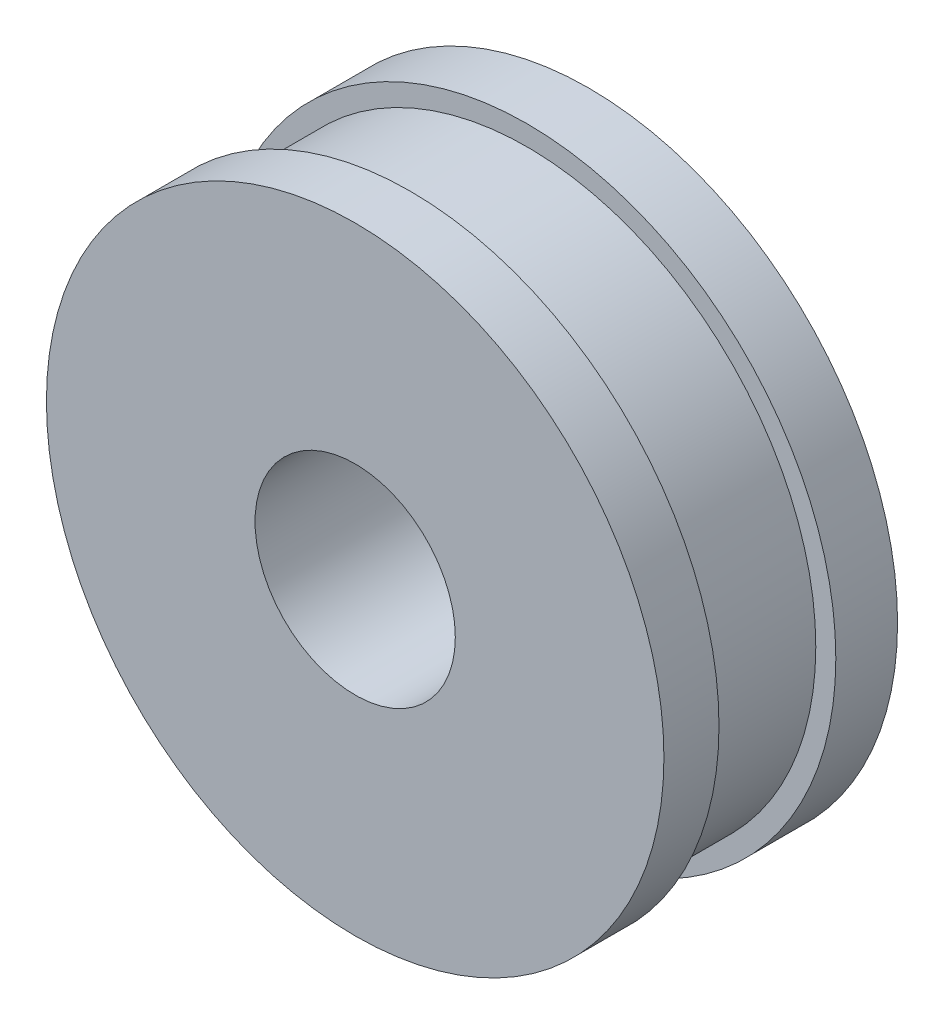
ISO-10303-21;
HEADER;
FILE_DESCRIPTION(('STEP AP214'),'2;1');
FILE_NAME('part.step','',(''),(''),'','','');
FILE_SCHEMA(('AUTOMOTIVE_DESIGN { 1 0 10303 214 1 1 1 1 }'));
ENDSEC;
DATA;
#1=APPLICATION_CONTEXT('core data for automotive mechanical design processes');
#2=APPLICATION_PROTOCOL_DEFINITION('international standard','automotive_design',2000,#1);
#3=PRODUCT_CONTEXT('',#1,'mechanical');
#4=PRODUCT('Part','Part','',(#3));
#5=PRODUCT_RELATED_PRODUCT_CATEGORY('part','',(#4));
#6=PRODUCT_DEFINITION_FORMATION('','',#4);
#7=PRODUCT_DEFINITION_CONTEXT('part definition',#1,'design');
#8=PRODUCT_DEFINITION('design','',#6,#7);
#9=PRODUCT_DEFINITION_SHAPE('','',#8);
#10=(LENGTH_UNIT() NAMED_UNIT(*) SI_UNIT(.MILLI.,.METRE.));
#11=(NAMED_UNIT(*) PLANE_ANGLE_UNIT() SI_UNIT($,.RADIAN.));
#12=(NAMED_UNIT(*) SI_UNIT($,.STERADIAN.) SOLID_ANGLE_UNIT());
#13=UNCERTAINTY_MEASURE_WITH_UNIT(LENGTH_MEASURE(1.E-05),#10,'distance_accuracy_value','');
#14=(GEOMETRIC_REPRESENTATION_CONTEXT(3) GLOBAL_UNCERTAINTY_ASSIGNED_CONTEXT((#13)) GLOBAL_UNIT_ASSIGNED_CONTEXT((#10,
#11,#12)) REPRESENTATION_CONTEXT('',''));
#15=CARTESIAN_POINT('',(0.,0.,0.));
#16=DIRECTION('',(0.,0.,1.));
#17=DIRECTION('',(1.,0.,0.));
#18=AXIS2_PLACEMENT_3D('',#15,#16,#17);
#19=CARTESIAN_POINT('',(0.,0.,14.));
#20=DIRECTION('',(0.,0.,-1.));
#21=DIRECTION('',(-1.,0.,0.));
#22=AXIS2_PLACEMENT_3D('',#19,#20,#21);
#23=CYLINDRICAL_SURFACE('',#22,18.5);
#24=CARTESIAN_POINT('',(0.,0.,0.));
#25=DIRECTION('',(0.,0.,1.));
#26=DIRECTION('',(1.,0.,0.));
#27=AXIS2_PLACEMENT_3D('',#24,#25,#26);
#28=CIRCLE('',#27,18.5);
#29=CARTESIAN_POINT('',(18.5,0.,0.));
#30=VERTEX_POINT('',#29);
#31=EDGE_CURVE('E35',#30,#30,#28,.T.);
#32=ORIENTED_EDGE('',*,*,#31,.T.);
#33=EDGE_LOOP('',(#32));
#34=FACE_BOUND('',#33,.T.);
#35=CARTESIAN_POINT('',(0.,0.,3.7));
#36=DIRECTION('',(0.,0.,1.));
#37=DIRECTION('',(1.,0.,0.));
#38=AXIS2_PLACEMENT_3D('',#35,#36,#37);
#39=CIRCLE('',#38,18.5);
#40=CARTESIAN_POINT('',(18.5,0.,3.7));
#41=VERTEX_POINT('',#40);
#42=EDGE_CURVE('E47',#41,#41,#39,.T.);
#43=ORIENTED_EDGE('',*,*,#42,.F.);
#44=EDGE_LOOP('',(#43));
#45=FACE_BOUND('',#44,.T.);
#46=ADVANCED_FACE('F31',(#34,#45),#23,.T.);
#47=CARTESIAN_POINT('',(0.,0.,14.));
#48=DIRECTION('',(0.,0.,1.));
#49=DIRECTION('',(1.,0.,0.));
#50=AXIS2_PLACEMENT_3D('',#47,#48,#49);
#51=PLANE('',#50);
#52=CARTESIAN_POINT('',(0.,0.,14.));
#53=DIRECTION('',(0.,0.,1.));
#54=DIRECTION('',(1.,0.,0.));
#55=AXIS2_PLACEMENT_3D('',#52,#53,#54);
#56=CIRCLE('',#55,18.5);
#57=CARTESIAN_POINT('',(18.5,0.,14.));
#58=VERTEX_POINT('',#57);
#59=EDGE_CURVE('E10',#58,#58,#56,.T.);
#60=ORIENTED_EDGE('',*,*,#59,.T.);
#61=EDGE_LOOP('',(#60));
#62=FACE_BOUND('',#61,.T.);
#63=CARTESIAN_POINT('',(0.,0.,14.));
#64=DIRECTION('',(0.,0.,1.));
#65=DIRECTION('',(1.,0.,0.));
#66=AXIS2_PLACEMENT_3D('',#63,#64,#65);
#67=CIRCLE('',#66,6.);
#68=CARTESIAN_POINT('',(6.,0.,14.));
#69=VERTEX_POINT('',#68);
#70=EDGE_CURVE('E42',#69,#69,#67,.T.);
#71=ORIENTED_EDGE('',*,*,#70,.F.);
#72=EDGE_LOOP('',(#71));
#73=FACE_BOUND('',#72,.T.);
#74=ADVANCED_FACE('F78',(#62,#73),#51,.T.);
#75=CARTESIAN_POINT('',(0.,0.,0.));
#76=DIRECTION('',(0.,0.,1.));
#77=DIRECTION('',(1.,0.,0.));
#78=AXIS2_PLACEMENT_3D('',#75,#76,#77);
#79=PLANE('',#78);
#80=ORIENTED_EDGE('',*,*,#31,.F.);
#81=EDGE_LOOP('',(#80));
#82=FACE_BOUND('',#81,.T.);
#83=CARTESIAN_POINT('',(0.,0.,0.));
#84=DIRECTION('',(0.,0.,1.));
#85=DIRECTION('',(1.,0.,0.));
#86=AXIS2_PLACEMENT_3D('',#83,#84,#85);
#87=CIRCLE('',#86,6.);
#88=CARTESIAN_POINT('',(6.,0.,0.));
#89=VERTEX_POINT('',#88);
#90=EDGE_CURVE('E44',#89,#89,#87,.T.);
#91=ORIENTED_EDGE('',*,*,#90,.T.);
#92=EDGE_LOOP('',(#91));
#93=FACE_BOUND('',#92,.T.);
#94=ADVANCED_FACE('F83',(#82,#93),#79,.F.);
#95=CARTESIAN_POINT('',(0.,0.,10.7));
#96=DIRECTION('',(0.,0.,1.));
#97=DIRECTION('',(1.,0.,0.));
#98=AXIS2_PLACEMENT_3D('',#95,#96,#97);
#99=CIRCLE('',#98,18.5);
#100=CARTESIAN_POINT('',(18.5,0.,10.7));
#101=VERTEX_POINT('',#100);
#102=EDGE_CURVE('E55',#101,#101,#99,.T.);
#103=ORIENTED_EDGE('',*,*,#102,.T.);
#104=EDGE_LOOP('',(#103));
#105=FACE_BOUND('',#104,.T.);
#106=ORIENTED_EDGE('',*,*,#59,.F.);
#107=EDGE_LOOP('',(#106));
#108=FACE_BOUND('',#107,.T.);
#109=ADVANCED_FACE('F33',(#105,#108),#23,.T.);
#110=CARTESIAN_POINT('',(0.,0.,14.));
#111=DIRECTION('',(0.,0.,-1.));
#112=DIRECTION('',(-1.,0.,0.));
#113=AXIS2_PLACEMENT_3D('',#110,#111,#112);
#114=CYLINDRICAL_SURFACE('',#113,6.);
#115=ORIENTED_EDGE('',*,*,#70,.T.);
#116=EDGE_LOOP('',(#115));
#117=FACE_BOUND('',#116,.T.);
#118=ORIENTED_EDGE('',*,*,#90,.F.);
#119=EDGE_LOOP('',(#118));
#120=FACE_BOUND('',#119,.T.);
#121=ADVANCED_FACE('F68',(#117,#120),#114,.F.);
#122=CARTESIAN_POINT('',(0.,0.,5.5));
#123=DIRECTION('',(0.,0.,1.));
#124=DIRECTION('',(1.,0.,0.));
#125=AXIS2_PLACEMENT_3D('',#122,#123,#124);
#126=CYLINDRICAL_SURFACE('',#125,17.3);
#127=CARTESIAN_POINT('',(0.,0.,10.7));
#128=DIRECTION('',(0.,0.,1.));
#129=DIRECTION('',(1.,0.,0.));
#130=AXIS2_PLACEMENT_3D('',#127,#128,#129);
#131=CIRCLE('',#130,17.3);
#132=CARTESIAN_POINT('',(17.3,0.,10.7));
#133=VERTEX_POINT('',#132);
#134=EDGE_CURVE('E58',#133,#133,#131,.T.);
#135=ORIENTED_EDGE('',*,*,#134,.F.);
#136=EDGE_LOOP('',(#135));
#137=FACE_BOUND('',#136,.T.);
#138=CARTESIAN_POINT('',(0.,0.,3.7));
#139=DIRECTION('',(0.,0.,1.));
#140=DIRECTION('',(1.,0.,0.));
#141=AXIS2_PLACEMENT_3D('',#138,#139,#140);
#142=CIRCLE('',#141,17.3);
#143=CARTESIAN_POINT('',(17.3,0.,3.7));
#144=VERTEX_POINT('',#143);
#145=EDGE_CURVE('E52',#144,#144,#142,.T.);
#146=ORIENTED_EDGE('',*,*,#145,.T.);
#147=EDGE_LOOP('',(#146));
#148=FACE_BOUND('',#147,.T.);
#149=ADVANCED_FACE('F64',(#137,#148),#126,.T.);
#150=CARTESIAN_POINT('',(0.,0.,3.7));
#151=DIRECTION('',(0.,0.,1.));
#152=DIRECTION('',(1.,0.,0.));
#153=AXIS2_PLACEMENT_3D('',#150,#151,#152);
#154=PLANE('',#153);
#155=ORIENTED_EDGE('',*,*,#145,.F.);
#156=EDGE_LOOP('',(#155));
#157=FACE_BOUND('',#156,.T.);
#158=ORIENTED_EDGE('',*,*,#42,.T.);
#159=EDGE_LOOP('',(#158));
#160=FACE_BOUND('',#159,.T.);
#161=ADVANCED_FACE('F67',(#157,#160),#154,.T.);
#162=CARTESIAN_POINT('',(0.,0.,10.7));
#163=DIRECTION('',(0.,0.,1.));
#164=DIRECTION('',(1.,0.,0.));
#165=AXIS2_PLACEMENT_3D('',#162,#163,#164);
#166=PLANE('',#165);
#167=ORIENTED_EDGE('',*,*,#102,.F.);
#168=EDGE_LOOP('',(#167));
#169=FACE_BOUND('',#168,.T.);
#170=ORIENTED_EDGE('',*,*,#134,.T.);
#171=EDGE_LOOP('',(#170));
#172=FACE_BOUND('',#171,.T.);
#173=ADVANCED_FACE('F62',(#169,#172),#166,.F.);
#174=CLOSED_SHELL('',(#46,#74,#94,#109,#121,#149,#161,#173));
#175=MANIFOLD_SOLID_BREP('B2',#174);
#176=ADVANCED_BREP_SHAPE_REPRESENTATION('',(#18,#175),#14);
#177=SHAPE_DEFINITION_REPRESENTATION(#9,#176);
ENDSEC;
END-ISO-10303-21;
